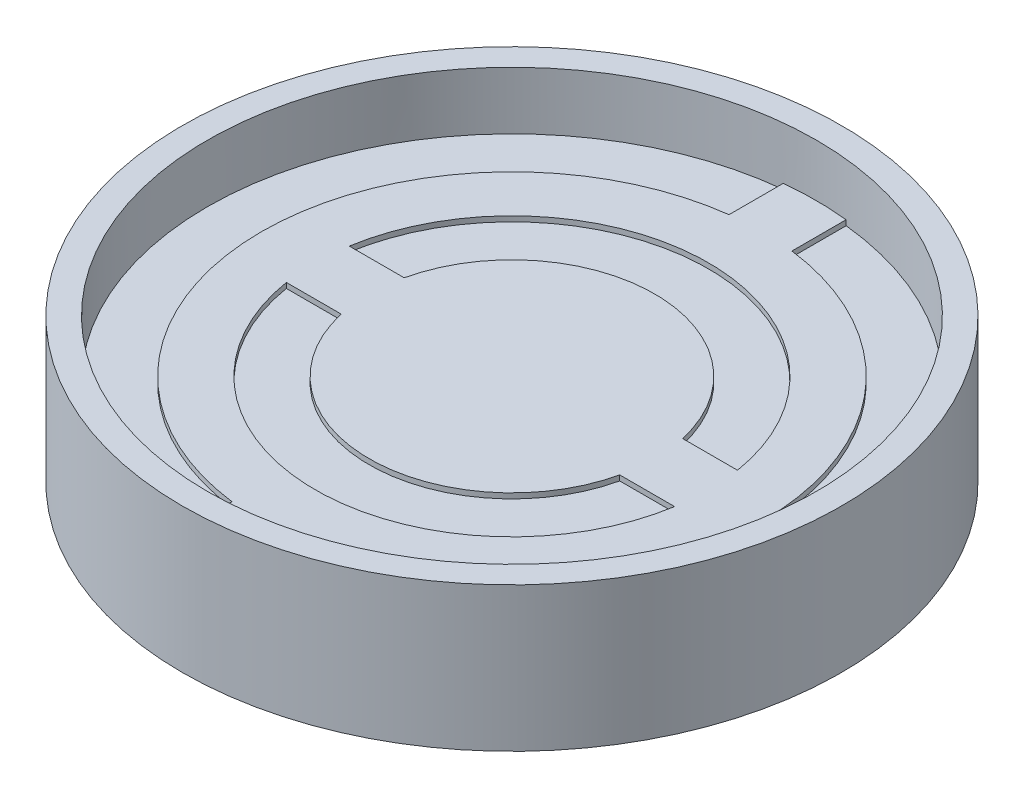
ISO-10303-21;
HEADER;
FILE_DESCRIPTION(('STEP AP214'),'2;1');
FILE_NAME('part.step','',(''),(''),'','','');
FILE_SCHEMA(('AUTOMOTIVE_DESIGN { 1 0 10303 214 1 1 1 1 }'));
ENDSEC;
DATA;
#1=APPLICATION_CONTEXT('core data for automotive mechanical design processes');
#2=APPLICATION_PROTOCOL_DEFINITION('international standard','automotive_design',2000,#1);
#3=PRODUCT_CONTEXT('',#1,'mechanical');
#4=PRODUCT('Part','Part','',(#3));
#5=PRODUCT_RELATED_PRODUCT_CATEGORY('part','',(#4));
#6=PRODUCT_DEFINITION_FORMATION('','',#4);
#7=PRODUCT_DEFINITION_CONTEXT('part definition',#1,'design');
#8=PRODUCT_DEFINITION('design','',#6,#7);
#9=PRODUCT_DEFINITION_SHAPE('','',#8);
#10=(LENGTH_UNIT() NAMED_UNIT(*) SI_UNIT(.MILLI.,.METRE.));
#11=(NAMED_UNIT(*) PLANE_ANGLE_UNIT() SI_UNIT($,.RADIAN.));
#12=(NAMED_UNIT(*) SI_UNIT($,.STERADIAN.) SOLID_ANGLE_UNIT());
#13=UNCERTAINTY_MEASURE_WITH_UNIT(LENGTH_MEASURE(1.E-05),#10,'distance_accuracy_value','');
#14=(GEOMETRIC_REPRESENTATION_CONTEXT(3) GLOBAL_UNCERTAINTY_ASSIGNED_CONTEXT((#13)) GLOBAL_UNIT_ASSIGNED_CONTEXT((#10,
#11,#12)) REPRESENTATION_CONTEXT('',''));
#15=CARTESIAN_POINT('',(0.,0.,0.));
#16=DIRECTION('',(0.,0.,1.));
#17=DIRECTION('',(1.,0.,0.));
#18=AXIS2_PLACEMENT_3D('',#15,#16,#17);
#19=CARTESIAN_POINT('',(0.,-0.6985,0.));
#20=DIRECTION('',(0.,-1.,0.));
#21=DIRECTION('',(0.,0.,1.));
#22=AXIS2_PLACEMENT_3D('',#19,#20,#21);
#23=PLANE('',#22);
#24=CARTESIAN_POINT('',(0.,-0.6985,0.));
#25=DIRECTION('',(0.,1.,0.));
#26=DIRECTION('',(0.,0.,1.));
#27=AXIS2_PLACEMENT_3D('',#24,#25,#26);
#28=CIRCLE('',#27,12.13485);
#29=CARTESIAN_POINT('',(1.524,-0.6985,12.0387710553237));
#30=VERTEX_POINT('',#29);
#31=CARTESIAN_POINT('',(1.524,-0.6985,-12.0387710553237));
#32=VERTEX_POINT('',#31);
#33=EDGE_CURVE('E360',#30,#32,#28,.T.);
#34=ORIENTED_EDGE('',*,*,#33,.T.);
#35=DIRECTION('',(0.,0.,1.));
#36=VECTOR('',#35,1.);
#37=CARTESIAN_POINT('',(1.524,-0.6985,0.));
#38=LINE('',#37,#36);
#39=CARTESIAN_POINT('',(1.524,-0.6985,-14.6657288291445));
#40=VERTEX_POINT('',#39);
#41=EDGE_CURVE('E356',#40,#32,#38,.T.);
#42=ORIENTED_EDGE('',*,*,#41,.F.);
#43=CARTESIAN_POINT('',(0.,-0.6985,0.));
#44=DIRECTION('',(0.,1.,0.));
#45=DIRECTION('',(0.,0.,1.));
#46=AXIS2_PLACEMENT_3D('',#43,#44,#45);
#47=CIRCLE('',#46,14.7447);
#48=CARTESIAN_POINT('',(1.524,-0.6985,14.6657288291445));
#49=VERTEX_POINT('',#48);
#50=EDGE_CURVE('E422',#49,#40,#47,.T.);
#51=ORIENTED_EDGE('',*,*,#50,.F.);
#52=DIRECTION('',(0.,0.,-1.));
#53=VECTOR('',#52,1.);
#54=CARTESIAN_POINT('',(1.524,-0.6985,0.));
#55=LINE('',#54,#53);
#56=EDGE_CURVE('E363',#49,#30,#55,.T.);
#57=ORIENTED_EDGE('',*,*,#56,.T.);
#58=EDGE_LOOP('',(#34,#42,#51,#57));
#59=FACE_BOUND('',#58,.T.);
#60=ADVANCED_FACE('F47',(#59),#23,.T.);
#61=CARTESIAN_POINT('',(0.,0.6985,0.));
#62=DIRECTION('',(0.,1.,0.));
#63=DIRECTION('',(0.,0.,1.));
#64=AXIS2_PLACEMENT_3D('',#61,#62,#63);
#65=CYLINDRICAL_SURFACE('',#64,14.7447);
#66=CARTESIAN_POINT('',(0.,3.4925,0.));
#67=DIRECTION('',(0.,1.,0.));
#68=DIRECTION('',(0.,0.,1.));
#69=AXIS2_PLACEMENT_3D('',#66,#67,#68);
#70=CIRCLE('',#69,14.7447);
#71=CARTESIAN_POINT('',(0.,3.4925,14.7447));
#72=VERTEX_POINT('',#71);
#73=EDGE_CURVE('E562',#72,#72,#70,.T.);
#74=ORIENTED_EDGE('',*,*,#73,.T.);
#75=EDGE_LOOP('',(#74));
#76=FACE_BOUND('',#75,.T.);
#77=DIRECTION('',(0.,-1.,0.));
#78=VECTOR('',#77,1.);
#79=CARTESIAN_POINT('',(-1.524,0.9525,-14.6657288291445));
#80=LINE('',#79,#78);
#81=CARTESIAN_POINT('',(-1.524,0.9525,-14.6657288291445));
#82=VERTEX_POINT('',#81);
#83=CARTESIAN_POINT('',(-1.524,0.6985,-14.6657288291445));
#84=VERTEX_POINT('',#83);
#85=EDGE_CURVE('E530',#82,#84,#80,.T.);
#86=ORIENTED_EDGE('',*,*,#85,.F.);
#87=CARTESIAN_POINT('',(0.,0.9525,0.));
#88=DIRECTION('',(0.,1.,0.));
#89=DIRECTION('',(0.,0.,1.));
#90=AXIS2_PLACEMENT_3D('',#87,#88,#89);
#91=CIRCLE('',#90,14.7447);
#92=CARTESIAN_POINT('',(1.524,0.9525,-14.6657288291445));
#93=VERTEX_POINT('',#92);
#94=EDGE_CURVE('E482',#93,#82,#91,.T.);
#95=ORIENTED_EDGE('',*,*,#94,.F.);
#96=DIRECTION('',(0.,-1.,0.));
#97=VECTOR('',#96,1.);
#98=CARTESIAN_POINT('',(1.524,0.9525,-14.6657288291445));
#99=LINE('',#98,#97);
#100=CARTESIAN_POINT('',(1.524,0.6985,-14.6657288291445));
#101=VERTEX_POINT('',#100);
#102=EDGE_CURVE('E534',#93,#101,#99,.T.);
#103=ORIENTED_EDGE('',*,*,#102,.T.);
#104=CARTESIAN_POINT('',(0.,0.6985,0.));
#105=DIRECTION('',(0.,1.,0.));
#106=DIRECTION('',(0.,0.,1.));
#107=AXIS2_PLACEMENT_3D('',#104,#105,#106);
#108=CIRCLE('',#107,14.7447);
#109=CARTESIAN_POINT('',(1.524,0.6985,14.6657288291445));
#110=VERTEX_POINT('',#109);
#111=EDGE_CURVE('E591',#110,#101,#108,.T.);
#112=ORIENTED_EDGE('',*,*,#111,.F.);
#113=DIRECTION('',(0.,-1.,0.));
#114=VECTOR('',#113,1.);
#115=CARTESIAN_POINT('',(1.524,0.9525,14.6657288291445));
#116=LINE('',#115,#114);
#117=CARTESIAN_POINT('',(1.524,0.9525,14.6657288291445));
#118=VERTEX_POINT('',#117);
#119=EDGE_CURVE('E547',#118,#110,#116,.T.);
#120=ORIENTED_EDGE('',*,*,#119,.F.);
#121=CARTESIAN_POINT('',(0.,0.9525,0.));
#122=DIRECTION('',(0.,1.,0.));
#123=DIRECTION('',(0.,0.,1.));
#124=AXIS2_PLACEMENT_3D('',#121,#122,#123);
#125=CIRCLE('',#124,14.7447);
#126=CARTESIAN_POINT('',(-1.524,0.9525,14.6657288291445));
#127=VERTEX_POINT('',#126);
#128=EDGE_CURVE('E471',#127,#118,#125,.T.);
#129=ORIENTED_EDGE('',*,*,#128,.F.);
#130=DIRECTION('',(0.,-1.,0.));
#131=VECTOR('',#130,1.);
#132=CARTESIAN_POINT('',(-1.524,0.9525,14.6657288291445));
#133=LINE('',#132,#131);
#134=CARTESIAN_POINT('',(-1.524,0.6985,14.6657288291445));
#135=VERTEX_POINT('',#134);
#136=EDGE_CURVE('E551',#127,#135,#133,.T.);
#137=ORIENTED_EDGE('',*,*,#136,.T.);
#138=EDGE_CURVE('E594',#84,#135,#108,.T.);
#139=ORIENTED_EDGE('',*,*,#138,.F.);
#140=EDGE_LOOP('',(#86,#95,#103,#112,#120,#129,#137,#139));
#141=FACE_BOUND('',#140,.T.);
#142=ADVANCED_FACE('F617',(#76,#141),#65,.F.);
#143=CARTESIAN_POINT('',(0.,0.6985,0.));
#144=DIRECTION('',(0.,1.,0.));
#145=DIRECTION('',(0.,0.,1.));
#146=AXIS2_PLACEMENT_3D('',#143,#144,#145);
#147=PLANE('',#146);
#148=CARTESIAN_POINT('',(0.,0.6985,0.));
#149=DIRECTION('',(0.,1.,0.));
#150=DIRECTION('',(0.,0.,1.));
#151=AXIS2_PLACEMENT_3D('',#148,#149,#150);
#152=CIRCLE('',#151,12.13485);
#153=CARTESIAN_POINT('',(-1.524,0.6985,-12.0387710553237));
#154=VERTEX_POINT('',#153);
#155=CARTESIAN_POINT('',(-1.524,0.6985,12.0387710553237));
#156=VERTEX_POINT('',#155);
#157=EDGE_CURVE('E516',#154,#156,#152,.T.);
#158=ORIENTED_EDGE('',*,*,#157,.F.);
#159=DIRECTION('',(0.,0.,1.));
#160=VECTOR('',#159,1.);
#161=CARTESIAN_POINT('',(-1.524,0.6985,0.));
#162=LINE('',#161,#160);
#163=EDGE_CURVE('E512',#84,#154,#162,.T.);
#164=ORIENTED_EDGE('',*,*,#163,.F.);
#165=ORIENTED_EDGE('',*,*,#138,.T.);
#166=DIRECTION('',(0.,0.,-1.));
#167=VECTOR('',#166,1.);
#168=CARTESIAN_POINT('',(-1.524,0.6985,0.));
#169=LINE('',#168,#167);
#170=EDGE_CURVE('E520',#135,#156,#169,.T.);
#171=ORIENTED_EDGE('',*,*,#170,.T.);
#172=EDGE_LOOP('',(#158,#164,#165,#171));
#173=FACE_BOUND('',#172,.T.);
#174=ADVANCED_FACE('F604',(#173),#147,.T.);
#175=CARTESIAN_POINT('',(1.524,0.6985,12.0387710553237));
#176=VERTEX_POINT('',#175);
#177=CARTESIAN_POINT('',(1.524,0.6985,-12.0387710553237));
#178=VERTEX_POINT('',#177);
#179=EDGE_CURVE('E521',#176,#178,#152,.T.);
#180=ORIENTED_EDGE('',*,*,#179,.F.);
#181=DIRECTION('',(0.,0.,-1.));
#182=VECTOR('',#181,1.);
#183=CARTESIAN_POINT('',(1.524,0.6985,0.));
#184=LINE('',#183,#182);
#185=EDGE_CURVE('E524',#110,#176,#184,.T.);
#186=ORIENTED_EDGE('',*,*,#185,.F.);
#187=ORIENTED_EDGE('',*,*,#111,.T.);
#188=DIRECTION('',(0.,0.,1.));
#189=VECTOR('',#188,1.);
#190=CARTESIAN_POINT('',(1.524,0.6985,0.));
#191=LINE('',#190,#189);
#192=EDGE_CURVE('E435',#101,#178,#191,.T.);
#193=ORIENTED_EDGE('',*,*,#192,.T.);
#194=EDGE_LOOP('',(#180,#186,#187,#193));
#195=FACE_BOUND('',#194,.T.);
#196=ADVANCED_FACE('F827',(#195),#147,.T.);
#197=CARTESIAN_POINT('',(0.,3.4925,0.));
#198=DIRECTION('',(0.,-1.,0.));
#199=DIRECTION('',(0.,0.,-1.));
#200=AXIS2_PLACEMENT_3D('',#197,#198,#199);
#201=CYLINDRICAL_SURFACE('',#200,15.9639);
#202=CARTESIAN_POINT('',(0.,3.4925,0.));
#203=DIRECTION('',(0.,1.,0.));
#204=DIRECTION('',(0.,0.,1.));
#205=AXIS2_PLACEMENT_3D('',#202,#203,#204);
#206=CIRCLE('',#205,15.9639);
#207=CARTESIAN_POINT('',(0.,3.4925,15.9639));
#208=VERTEX_POINT('',#207);
#209=EDGE_CURVE('E11',#208,#208,#206,.T.);
#210=ORIENTED_EDGE('',*,*,#209,.F.);
#211=EDGE_LOOP('',(#210));
#212=FACE_BOUND('',#211,.T.);
#213=CARTESIAN_POINT('',(0.,-3.4925,0.));
#214=DIRECTION('',(0.,1.,0.));
#215=DIRECTION('',(0.,0.,1.));
#216=AXIS2_PLACEMENT_3D('',#213,#214,#215);
#217=CIRCLE('',#216,15.9639);
#218=CARTESIAN_POINT('',(0.,-3.4925,15.9639));
#219=VERTEX_POINT('',#218);
#220=EDGE_CURVE('E51',#219,#219,#217,.T.);
#221=ORIENTED_EDGE('',*,*,#220,.T.);
#222=EDGE_LOOP('',(#221));
#223=FACE_BOUND('',#222,.T.);
#224=ADVANCED_FACE('F49',(#212,#223),#201,.T.);
#225=CARTESIAN_POINT('',(0.,3.4925,0.));
#226=DIRECTION('',(0.,1.,0.));
#227=DIRECTION('',(0.,0.,1.));
#228=AXIS2_PLACEMENT_3D('',#225,#226,#227);
#229=PLANE('',#228);
#230=ORIENTED_EDGE('',*,*,#73,.F.);
#231=EDGE_LOOP('',(#230));
#232=FACE_BOUND('',#231,.T.);
#233=ORIENTED_EDGE('',*,*,#209,.T.);
#234=EDGE_LOOP('',(#233));
#235=FACE_BOUND('',#234,.T.);
#236=ADVANCED_FACE('F806',(#232,#235),#229,.T.);
#237=CARTESIAN_POINT('',(0.,-3.4925,0.));
#238=DIRECTION('',(0.,1.,0.));
#239=DIRECTION('',(0.,0.,1.));
#240=AXIS2_PLACEMENT_3D('',#237,#238,#239);
#241=PLANE('',#240);
#242=CARTESIAN_POINT('',(0.,-3.4925,0.));
#243=DIRECTION('',(0.,1.,0.));
#244=DIRECTION('',(0.,0.,1.));
#245=AXIS2_PLACEMENT_3D('',#242,#243,#244);
#246=CIRCLE('',#245,14.7447);
#247=CARTESIAN_POINT('',(0.,-3.4925,14.7447));
#248=VERTEX_POINT('',#247);
#249=EDGE_CURVE('E399',#248,#248,#246,.T.);
#250=ORIENTED_EDGE('',*,*,#249,.T.);
#251=EDGE_LOOP('',(#250));
#252=FACE_BOUND('',#251,.T.);
#253=ORIENTED_EDGE('',*,*,#220,.F.);
#254=EDGE_LOOP('',(#253));
#255=FACE_BOUND('',#254,.T.);
#256=ADVANCED_FACE('F802',(#252,#255),#241,.F.);
#257=CARTESIAN_POINT('',(-1.524,0.9525,0.));
#258=DIRECTION('',(1.,0.,0.));
#259=DIRECTION('',(0.,0.,-1.));
#260=AXIS2_PLACEMENT_3D('',#257,#258,#259);
#261=PLANE('',#260);
#262=ORIENTED_EDGE('',*,*,#163,.T.);
#263=DIRECTION('',(0.,-1.,0.));
#264=VECTOR('',#263,1.);
#265=CARTESIAN_POINT('',(-1.524,0.9525,-12.0387710553237));
#266=LINE('',#265,#264);
#267=CARTESIAN_POINT('',(-1.524,0.9525,-12.0387710553237));
#268=VERTEX_POINT('',#267);
#269=EDGE_CURVE('E558',#268,#154,#266,.T.);
#270=ORIENTED_EDGE('',*,*,#269,.F.);
#271=DIRECTION('',(0.,0.,1.));
#272=VECTOR('',#271,1.);
#273=CARTESIAN_POINT('',(-1.524,0.9525,0.));
#274=LINE('',#273,#272);
#275=EDGE_CURVE('E459',#82,#268,#274,.T.);
#276=ORIENTED_EDGE('',*,*,#275,.F.);
#277=ORIENTED_EDGE('',*,*,#85,.T.);
#278=EDGE_LOOP('',(#262,#270,#276,#277));
#279=FACE_BOUND('',#278,.T.);
#280=ADVANCED_FACE('F616',(#279),#261,.F.);
#281=CARTESIAN_POINT('',(0.,0.9525,0.));
#282=DIRECTION('',(0.,-1.,0.));
#283=DIRECTION('',(0.,0.,-1.));
#284=AXIS2_PLACEMENT_3D('',#281,#282,#283);
#285=CYLINDRICAL_SURFACE('',#284,12.13485);
#286=ORIENTED_EDGE('',*,*,#157,.T.);
#287=DIRECTION('',(0.,-1.,0.));
#288=VECTOR('',#287,1.);
#289=CARTESIAN_POINT('',(-1.524,0.9525,12.0387710553237));
#290=LINE('',#289,#288);
#291=CARTESIAN_POINT('',(-1.524,0.9525,12.0387710553237));
#292=VERTEX_POINT('',#291);
#293=EDGE_CURVE('E554',#292,#156,#290,.T.);
#294=ORIENTED_EDGE('',*,*,#293,.F.);
#295=CARTESIAN_POINT('',(0.,0.9525,0.));
#296=DIRECTION('',(0.,1.,0.));
#297=DIRECTION('',(0.,0.,1.));
#298=AXIS2_PLACEMENT_3D('',#295,#296,#297);
#299=CIRCLE('',#298,12.13485);
#300=EDGE_CURVE('E463',#268,#292,#299,.T.);
#301=ORIENTED_EDGE('',*,*,#300,.F.);
#302=ORIENTED_EDGE('',*,*,#269,.T.);
#303=EDGE_LOOP('',(#286,#294,#301,#302));
#304=FACE_BOUND('',#303,.T.);
#305=ADVANCED_FACE('F612',(#304),#285,.T.);
#306=CARTESIAN_POINT('',(-1.524,0.9525,0.));
#307=DIRECTION('',(-1.,0.,0.));
#308=DIRECTION('',(0.,0.,1.));
#309=AXIS2_PLACEMENT_3D('',#306,#307,#308);
#310=PLANE('',#309);
#311=ORIENTED_EDGE('',*,*,#170,.F.);
#312=ORIENTED_EDGE('',*,*,#136,.F.);
#313=DIRECTION('',(0.,0.,-1.));
#314=VECTOR('',#313,1.);
#315=CARTESIAN_POINT('',(-1.524,0.9525,0.));
#316=LINE('',#315,#314);
#317=EDGE_CURVE('E466',#127,#292,#316,.T.);
#318=ORIENTED_EDGE('',*,*,#317,.T.);
#319=ORIENTED_EDGE('',*,*,#293,.T.);
#320=EDGE_LOOP('',(#311,#312,#318,#319));
#321=FACE_BOUND('',#320,.T.);
#322=ADVANCED_FACE('F608',(#321),#310,.T.);
#323=CARTESIAN_POINT('',(1.524,0.9525,0.));
#324=DIRECTION('',(-1.,0.,0.));
#325=DIRECTION('',(0.,0.,1.));
#326=AXIS2_PLACEMENT_3D('',#323,#324,#325);
#327=PLANE('',#326);
#328=ORIENTED_EDGE('',*,*,#185,.T.);
#329=DIRECTION('',(0.,-1.,0.));
#330=VECTOR('',#329,1.);
#331=CARTESIAN_POINT('',(1.524,0.9525,12.0387710553237));
#332=LINE('',#331,#330);
#333=CARTESIAN_POINT('',(1.524,0.9525,12.0387710553237));
#334=VERTEX_POINT('',#333);
#335=EDGE_CURVE('E543',#334,#176,#332,.T.);
#336=ORIENTED_EDGE('',*,*,#335,.F.);
#337=DIRECTION('',(0.,0.,-1.));
#338=VECTOR('',#337,1.);
#339=CARTESIAN_POINT('',(1.524,0.9525,0.));
#340=LINE('',#339,#338);
#341=EDGE_CURVE('E475',#118,#334,#340,.T.);
#342=ORIENTED_EDGE('',*,*,#341,.F.);
#343=ORIENTED_EDGE('',*,*,#119,.T.);
#344=EDGE_LOOP('',(#328,#336,#342,#343));
#345=FACE_BOUND('',#344,.T.);
#346=ADVANCED_FACE('F632',(#345),#327,.F.);
#347=ORIENTED_EDGE('',*,*,#179,.T.);
#348=DIRECTION('',(0.,-1.,0.));
#349=VECTOR('',#348,1.);
#350=CARTESIAN_POINT('',(1.524,0.9525,-12.0387710553237));
#351=LINE('',#350,#349);
#352=CARTESIAN_POINT('',(1.524,0.9525,-12.0387710553237));
#353=VERTEX_POINT('',#352);
#354=EDGE_CURVE('E539',#353,#178,#351,.T.);
#355=ORIENTED_EDGE('',*,*,#354,.F.);
#356=EDGE_CURVE('E467',#334,#353,#299,.T.);
#357=ORIENTED_EDGE('',*,*,#356,.F.);
#358=ORIENTED_EDGE('',*,*,#335,.T.);
#359=EDGE_LOOP('',(#347,#355,#357,#358));
#360=FACE_BOUND('',#359,.T.);
#361=ADVANCED_FACE('F635',(#360),#285,.T.);
#362=CARTESIAN_POINT('',(1.524,0.9525,0.));
#363=DIRECTION('',(1.,0.,0.));
#364=DIRECTION('',(0.,0.,-1.));
#365=AXIS2_PLACEMENT_3D('',#362,#363,#364);
#366=PLANE('',#365);
#367=ORIENTED_EDGE('',*,*,#192,.F.);
#368=ORIENTED_EDGE('',*,*,#102,.F.);
#369=DIRECTION('',(0.,0.,1.));
#370=VECTOR('',#369,1.);
#371=CARTESIAN_POINT('',(1.524,0.9525,0.));
#372=LINE('',#371,#370);
#373=EDGE_CURVE('E478',#93,#353,#372,.T.);
#374=ORIENTED_EDGE('',*,*,#373,.T.);
#375=ORIENTED_EDGE('',*,*,#354,.T.);
#376=EDGE_LOOP('',(#367,#368,#374,#375));
#377=FACE_BOUND('',#376,.T.);
#378=ADVANCED_FACE('F626',(#377),#366,.T.);
#379=CARTESIAN_POINT('',(0.,0.9525,0.));
#380=DIRECTION('',(0.,-1.,0.));
#381=DIRECTION('',(0.,0.,-1.));
#382=AXIS2_PLACEMENT_3D('',#379,#380,#381);
#383=CYLINDRICAL_SURFACE('',#382,9.525);
#384=CARTESIAN_POINT('',(0.,0.6985,0.));
#385=DIRECTION('',(0.,1.,0.));
#386=DIRECTION('',(0.,0.,1.));
#387=AXIS2_PLACEMENT_3D('',#384,#385,#386);
#388=CIRCLE('',#387,9.525);
#389=CARTESIAN_POINT('',(9.40228956159084,0.6985,-1.524));
#390=VERTEX_POINT('',#389);
#391=CARTESIAN_POINT('',(-9.40228956159084,0.6985,-1.524));
#392=VERTEX_POINT('',#391);
#393=EDGE_CURVE('E502',#390,#392,#388,.T.);
#394=ORIENTED_EDGE('',*,*,#393,.F.);
#395=DIRECTION('',(0.,-1.,0.));
#396=VECTOR('',#395,1.);
#397=CARTESIAN_POINT('',(9.40228956159084,0.9525,-1.524));
#398=LINE('',#397,#396);
#399=CARTESIAN_POINT('',(9.40228956159084,0.9525,-1.524));
#400=VERTEX_POINT('',#399);
#401=EDGE_CURVE('E535',#400,#390,#398,.T.);
#402=ORIENTED_EDGE('',*,*,#401,.F.);
#403=CARTESIAN_POINT('',(0.,0.9525,0.));
#404=DIRECTION('',(0.,1.,0.));
#405=DIRECTION('',(0.,0.,1.));
#406=AXIS2_PLACEMENT_3D('',#403,#404,#405);
#407=CIRCLE('',#406,9.525);
#408=CARTESIAN_POINT('',(-9.40228956159084,0.9525,-1.524));
#409=VERTEX_POINT('',#408);
#410=EDGE_CURVE('E447',#400,#409,#407,.T.);
#411=ORIENTED_EDGE('',*,*,#410,.T.);
#412=DIRECTION('',(0.,-1.,0.));
#413=VECTOR('',#412,1.);
#414=CARTESIAN_POINT('',(-9.40228956159084,0.9525,-1.524));
#415=LINE('',#414,#413);
#416=EDGE_CURVE('E563',#409,#392,#415,.T.);
#417=ORIENTED_EDGE('',*,*,#416,.T.);
#418=EDGE_LOOP('',(#394,#402,#411,#417));
#419=FACE_BOUND('',#418,.T.);
#420=ADVANCED_FACE('F920',(#419),#383,.F.);
#421=CARTESIAN_POINT('',(0.,0.9525,-1.524));
#422=DIRECTION('',(0.,0.,1.));
#423=DIRECTION('',(1.,0.,0.));
#424=AXIS2_PLACEMENT_3D('',#421,#422,#423);
#425=PLANE('',#424);
#426=DIRECTION('',(-1.,0.,0.));
#427=VECTOR('',#426,1.);
#428=CARTESIAN_POINT('',(0.,0.6985,-1.524));
#429=LINE('',#428,#427);
#430=CARTESIAN_POINT('',(6.7451259085728,0.6985,-1.524));
#431=VERTEX_POINT('',#430);
#432=EDGE_CURVE('E505',#390,#431,#429,.T.);
#433=ORIENTED_EDGE('',*,*,#432,.T.);
#434=DIRECTION('',(0.,-1.,0.));
#435=VECTOR('',#434,1.);
#436=CARTESIAN_POINT('',(6.7451259085728,0.9525,-1.524));
#437=LINE('',#436,#435);
#438=CARTESIAN_POINT('',(6.7451259085728,0.9525,-1.524));
#439=VERTEX_POINT('',#438);
#440=EDGE_CURVE('E572',#439,#431,#437,.T.);
#441=ORIENTED_EDGE('',*,*,#440,.F.);
#442=DIRECTION('',(-1.,0.,0.));
#443=VECTOR('',#442,1.);
#444=CARTESIAN_POINT('',(0.,0.9525,-1.524));
#445=LINE('',#444,#443);
#446=EDGE_CURVE('E451',#400,#439,#445,.T.);
#447=ORIENTED_EDGE('',*,*,#446,.F.);
#448=ORIENTED_EDGE('',*,*,#401,.T.);
#449=EDGE_LOOP('',(#433,#441,#447,#448));
#450=FACE_BOUND('',#449,.T.);
#451=ADVANCED_FACE('F910',(#450),#425,.F.);
#452=CARTESIAN_POINT('',(0.,0.9525,0.));
#453=DIRECTION('',(0.,-1.,0.));
#454=DIRECTION('',(0.,0.,-1.));
#455=AXIS2_PLACEMENT_3D('',#452,#453,#454);
#456=CYLINDRICAL_SURFACE('',#455,6.91515);
#457=CARTESIAN_POINT('',(0.,0.6985,0.));
#458=DIRECTION('',(0.,1.,0.));
#459=DIRECTION('',(0.,0.,1.));
#460=AXIS2_PLACEMENT_3D('',#457,#458,#459);
#461=CIRCLE('',#460,6.91515);
#462=CARTESIAN_POINT('',(-6.7451259085728,0.6985,-1.524));
#463=VERTEX_POINT('',#462);
#464=EDGE_CURVE('E491',#431,#463,#461,.T.);
#465=ORIENTED_EDGE('',*,*,#464,.T.);
#466=DIRECTION('',(0.,-1.,0.));
#467=VECTOR('',#466,1.);
#468=CARTESIAN_POINT('',(-6.7451259085728,0.9525,-1.524));
#469=LINE('',#468,#467);
#470=CARTESIAN_POINT('',(-6.7451259085728,0.9525,-1.524));
#471=VERTEX_POINT('',#470);
#472=EDGE_CURVE('E567',#471,#463,#469,.T.);
#473=ORIENTED_EDGE('',*,*,#472,.F.);
#474=CARTESIAN_POINT('',(0.,0.9525,0.));
#475=DIRECTION('',(0.,1.,0.));
#476=DIRECTION('',(0.,0.,1.));
#477=AXIS2_PLACEMENT_3D('',#474,#475,#476);
#478=CIRCLE('',#477,6.91515);
#479=EDGE_CURVE('E436',#439,#471,#478,.T.);
#480=ORIENTED_EDGE('',*,*,#479,.F.);
#481=ORIENTED_EDGE('',*,*,#440,.T.);
#482=EDGE_LOOP('',(#465,#473,#480,#481));
#483=FACE_BOUND('',#482,.T.);
#484=ADVANCED_FACE('F899',(#483),#456,.T.);
#485=CARTESIAN_POINT('',(-6.7451259085728,0.6985,1.524));
#486=VERTEX_POINT('',#485);
#487=CARTESIAN_POINT('',(6.7451259085728,0.6985,1.524));
#488=VERTEX_POINT('',#487);
#489=EDGE_CURVE('E426',#486,#488,#461,.T.);
#490=ORIENTED_EDGE('',*,*,#489,.T.);
#491=DIRECTION('',(0.,-1.,0.));
#492=VECTOR('',#491,1.);
#493=CARTESIAN_POINT('',(6.7451259085728,0.9525,1.524));
#494=LINE('',#493,#492);
#495=CARTESIAN_POINT('',(6.7451259085728,0.9525,1.524));
#496=VERTEX_POINT('',#495);
#497=EDGE_CURVE('E568',#496,#488,#494,.T.);
#498=ORIENTED_EDGE('',*,*,#497,.F.);
#499=CARTESIAN_POINT('',(-6.7451259085728,0.9525,1.524));
#500=VERTEX_POINT('',#499);
#501=EDGE_CURVE('E431',#500,#496,#478,.T.);
#502=ORIENTED_EDGE('',*,*,#501,.F.);
#503=DIRECTION('',(0.,-1.,0.));
#504=VECTOR('',#503,1.);
#505=CARTESIAN_POINT('',(-6.7451259085728,0.9525,1.524));
#506=LINE('',#505,#504);
#507=EDGE_CURVE('E486',#500,#486,#506,.T.);
#508=ORIENTED_EDGE('',*,*,#507,.T.);
#509=EDGE_LOOP('',(#490,#498,#502,#508));
#510=FACE_BOUND('',#509,.T.);
#511=ADVANCED_FACE('F888',(#510),#456,.T.);
#512=CARTESIAN_POINT('',(0.,0.9525,1.524));
#513=DIRECTION('',(0.,0.,1.));
#514=DIRECTION('',(1.,0.,0.));
#515=AXIS2_PLACEMENT_3D('',#512,#513,#514);
#516=PLANE('',#515);
#517=DIRECTION('',(-1.,0.,0.));
#518=VECTOR('',#517,1.);
#519=CARTESIAN_POINT('',(0.,0.6985,1.524));
#520=LINE('',#519,#518);
#521=CARTESIAN_POINT('',(9.40228956159084,0.6985,1.524));
#522=VERTEX_POINT('',#521);
#523=EDGE_CURVE('E490',#522,#488,#520,.T.);
#524=ORIENTED_EDGE('',*,*,#523,.F.);
#525=DIRECTION('',(0.,-1.,0.));
#526=VECTOR('',#525,1.);
#527=CARTESIAN_POINT('',(9.40228956159084,0.9525,1.524));
#528=LINE('',#527,#526);
#529=CARTESIAN_POINT('',(9.40228956159084,0.9525,1.524));
#530=VERTEX_POINT('',#529);
#531=EDGE_CURVE('E586',#530,#522,#528,.T.);
#532=ORIENTED_EDGE('',*,*,#531,.F.);
#533=DIRECTION('',(-1.,0.,0.));
#534=VECTOR('',#533,1.);
#535=CARTESIAN_POINT('',(0.,0.9525,1.524));
#536=LINE('',#535,#534);
#537=EDGE_CURVE('E434',#530,#496,#536,.T.);
#538=ORIENTED_EDGE('',*,*,#537,.T.);
#539=ORIENTED_EDGE('',*,*,#497,.T.);
#540=EDGE_LOOP('',(#524,#532,#538,#539));
#541=FACE_BOUND('',#540,.T.);
#542=ADVANCED_FACE('F877',(#541),#516,.T.);
#543=CARTESIAN_POINT('',(0.,0.9525,0.));
#544=DIRECTION('',(0.,-1.,0.));
#545=DIRECTION('',(0.,0.,-1.));
#546=AXIS2_PLACEMENT_3D('',#543,#544,#545);
#547=CYLINDRICAL_SURFACE('',#546,9.525);
#548=CARTESIAN_POINT('',(0.,0.6985,0.));
#549=DIRECTION('',(0.,1.,0.));
#550=DIRECTION('',(0.,0.,1.));
#551=AXIS2_PLACEMENT_3D('',#548,#549,#550);
#552=CIRCLE('',#551,9.525);
#553=CARTESIAN_POINT('',(-9.40228956159084,0.6985,1.524));
#554=VERTEX_POINT('',#553);
#555=EDGE_CURVE('E495',#554,#522,#552,.T.);
#556=ORIENTED_EDGE('',*,*,#555,.F.);
#557=DIRECTION('',(0.,-1.,0.));
#558=VECTOR('',#557,1.);
#559=CARTESIAN_POINT('',(-9.40228956159084,0.9525,1.524));
#560=LINE('',#559,#558);
#561=CARTESIAN_POINT('',(-9.40228956159084,0.9525,1.524));
#562=VERTEX_POINT('',#561);
#563=EDGE_CURVE('E582',#562,#554,#560,.T.);
#564=ORIENTED_EDGE('',*,*,#563,.F.);
#565=CARTESIAN_POINT('',(0.,0.9525,0.));
#566=DIRECTION('',(0.,1.,0.));
#567=DIRECTION('',(0.,0.,1.));
#568=AXIS2_PLACEMENT_3D('',#565,#566,#567);
#569=CIRCLE('',#568,9.525);
#570=EDGE_CURVE('E440',#562,#530,#569,.T.);
#571=ORIENTED_EDGE('',*,*,#570,.T.);
#572=ORIENTED_EDGE('',*,*,#531,.T.);
#573=EDGE_LOOP('',(#556,#564,#571,#572));
#574=FACE_BOUND('',#573,.T.);
#575=ADVANCED_FACE('F866',(#574),#547,.F.);
#576=CARTESIAN_POINT('',(0.,0.9525,-1.524));
#577=DIRECTION('',(0.,0.,-1.));
#578=DIRECTION('',(-1.,0.,0.));
#579=AXIS2_PLACEMENT_3D('',#576,#577,#578);
#580=PLANE('',#579);
#581=DIRECTION('',(1.,0.,0.));
#582=VECTOR('',#581,1.);
#583=CARTESIAN_POINT('',(0.,0.6985,-1.524));
#584=LINE('',#583,#582);
#585=EDGE_CURVE('E509',#392,#463,#584,.T.);
#586=ORIENTED_EDGE('',*,*,#585,.F.);
#587=ORIENTED_EDGE('',*,*,#416,.F.);
#588=DIRECTION('',(1.,0.,0.));
#589=VECTOR('',#588,1.);
#590=CARTESIAN_POINT('',(0.,0.9525,-1.524));
#591=LINE('',#590,#589);
#592=EDGE_CURVE('E455',#409,#471,#591,.T.);
#593=ORIENTED_EDGE('',*,*,#592,.T.);
#594=ORIENTED_EDGE('',*,*,#472,.T.);
#595=EDGE_LOOP('',(#586,#587,#593,#594));
#596=FACE_BOUND('',#595,.T.);
#597=ADVANCED_FACE('F854',(#596),#580,.T.);
#598=CARTESIAN_POINT('',(0.,0.9525,1.524));
#599=DIRECTION('',(0.,0.,-1.));
#600=DIRECTION('',(-1.,0.,0.));
#601=AXIS2_PLACEMENT_3D('',#598,#599,#600);
#602=PLANE('',#601);
#603=DIRECTION('',(1.,0.,0.));
#604=VECTOR('',#603,1.);
#605=CARTESIAN_POINT('',(0.,0.6985,1.524));
#606=LINE('',#605,#604);
#607=EDGE_CURVE('E499',#554,#486,#606,.T.);
#608=ORIENTED_EDGE('',*,*,#607,.T.);
#609=ORIENTED_EDGE('',*,*,#507,.F.);
#610=DIRECTION('',(1.,0.,0.));
#611=VECTOR('',#610,1.);
#612=CARTESIAN_POINT('',(0.,0.9525,1.524));
#613=LINE('',#612,#611);
#614=EDGE_CURVE('E444',#562,#500,#613,.T.);
#615=ORIENTED_EDGE('',*,*,#614,.F.);
#616=ORIENTED_EDGE('',*,*,#563,.T.);
#617=EDGE_LOOP('',(#608,#609,#615,#616));
#618=FACE_BOUND('',#617,.T.);
#619=ADVANCED_FACE('F843',(#618),#602,.F.);
#620=CARTESIAN_POINT('',(0.,0.9525,0.));
#621=DIRECTION('',(0.,1.,0.));
#622=DIRECTION('',(0.,0.,1.));
#623=AXIS2_PLACEMENT_3D('',#620,#621,#622);
#624=PLANE('',#623);
#625=ORIENTED_EDGE('',*,*,#501,.T.);
#626=ORIENTED_EDGE('',*,*,#537,.F.);
#627=ORIENTED_EDGE('',*,*,#570,.F.);
#628=ORIENTED_EDGE('',*,*,#614,.T.);
#629=EDGE_LOOP('',(#625,#626,#627,#628));
#630=FACE_BOUND('',#629,.T.);
#631=ORIENTED_EDGE('',*,*,#410,.F.);
#632=ORIENTED_EDGE('',*,*,#446,.T.);
#633=ORIENTED_EDGE('',*,*,#479,.T.);
#634=ORIENTED_EDGE('',*,*,#592,.F.);
#635=EDGE_LOOP('',(#631,#632,#633,#634));
#636=FACE_BOUND('',#635,.T.);
#637=ORIENTED_EDGE('',*,*,#275,.T.);
#638=ORIENTED_EDGE('',*,*,#300,.T.);
#639=ORIENTED_EDGE('',*,*,#317,.F.);
#640=ORIENTED_EDGE('',*,*,#128,.T.);
#641=ORIENTED_EDGE('',*,*,#341,.T.);
#642=ORIENTED_EDGE('',*,*,#356,.T.);
#643=ORIENTED_EDGE('',*,*,#373,.F.);
#644=ORIENTED_EDGE('',*,*,#94,.T.);
#645=EDGE_LOOP('',(#637,#638,#639,#640,#641,#642,#643,#644));
#646=FACE_BOUND('',#645,.T.);
#647=ADVANCED_FACE('F621',(#630,#636,#646),#624,.T.);
#648=ORIENTED_EDGE('',*,*,#393,.T.);
#649=ORIENTED_EDGE('',*,*,#585,.T.);
#650=ORIENTED_EDGE('',*,*,#464,.F.);
#651=ORIENTED_EDGE('',*,*,#432,.F.);
#652=EDGE_LOOP('',(#648,#649,#650,#651));
#653=FACE_BOUND('',#652,.T.);
#654=ADVANCED_FACE('F824',(#653),#147,.T.);
#655=ORIENTED_EDGE('',*,*,#523,.T.);
#656=ORIENTED_EDGE('',*,*,#489,.F.);
#657=ORIENTED_EDGE('',*,*,#607,.F.);
#658=ORIENTED_EDGE('',*,*,#555,.T.);
#659=EDGE_LOOP('',(#655,#656,#657,#658));
#660=FACE_BOUND('',#659,.T.);
#661=ADVANCED_FACE('F795',(#660),#147,.T.);
#662=CARTESIAN_POINT('',(0.,-0.6985,0.));
#663=DIRECTION('',(0.,-1.,0.));
#664=DIRECTION('',(0.,0.,-1.));
#665=AXIS2_PLACEMENT_3D('',#662,#663,#664);
#666=CYLINDRICAL_SURFACE('',#665,14.7447);
#667=DIRECTION('',(0.,1.,0.));
#668=VECTOR('',#667,1.);
#669=CARTESIAN_POINT('',(1.524,-0.9525,14.6657288291445));
#670=LINE('',#669,#668);
#671=CARTESIAN_POINT('',(1.524,-0.9525,14.6657288291445));
#672=VERTEX_POINT('',#671);
#673=EDGE_CURVE('E381',#672,#49,#670,.T.);
#674=ORIENTED_EDGE('',*,*,#673,.T.);
#675=ORIENTED_EDGE('',*,*,#50,.T.);
#676=DIRECTION('',(0.,1.,0.));
#677=VECTOR('',#676,1.);
#678=CARTESIAN_POINT('',(1.524,-0.9525,-14.6657288291445));
#679=LINE('',#678,#677);
#680=CARTESIAN_POINT('',(1.524,-0.9525,-14.6657288291445));
#681=VERTEX_POINT('',#680);
#682=EDGE_CURVE('E392',#681,#40,#679,.T.);
#683=ORIENTED_EDGE('',*,*,#682,.F.);
#684=CARTESIAN_POINT('',(0.,-0.9525,0.));
#685=DIRECTION('',(0.,1.,0.));
#686=DIRECTION('',(0.,0.,1.));
#687=AXIS2_PLACEMENT_3D('',#684,#685,#686);
#688=CIRCLE('',#687,14.7447);
#689=CARTESIAN_POINT('',(-1.524,-0.9525,-14.6657288291445));
#690=VERTEX_POINT('',#689);
#691=EDGE_CURVE('E308',#681,#690,#688,.T.);
#692=ORIENTED_EDGE('',*,*,#691,.T.);
#693=DIRECTION('',(0.,1.,0.));
#694=VECTOR('',#693,1.);
#695=CARTESIAN_POINT('',(-1.524,-0.9525,-14.6657288291445));
#696=LINE('',#695,#694);
#697=CARTESIAN_POINT('',(-1.524,-0.6985,-14.6657288291445));
#698=VERTEX_POINT('',#697);
#699=EDGE_CURVE('E396',#690,#698,#696,.T.);
#700=ORIENTED_EDGE('',*,*,#699,.T.);
#701=CARTESIAN_POINT('',(-1.524,-0.6985,14.6657288291445));
#702=VERTEX_POINT('',#701);
#703=EDGE_CURVE('E427',#698,#702,#47,.T.);
#704=ORIENTED_EDGE('',*,*,#703,.T.);
#705=DIRECTION('',(0.,1.,0.));
#706=VECTOR('',#705,1.);
#707=CARTESIAN_POINT('',(-1.524,-0.9525,14.6657288291445));
#708=LINE('',#707,#706);
#709=CARTESIAN_POINT('',(-1.524,-0.9525,14.6657288291445));
#710=VERTEX_POINT('',#709);
#711=EDGE_CURVE('E63',#710,#702,#708,.T.);
#712=ORIENTED_EDGE('',*,*,#711,.F.);
#713=CARTESIAN_POINT('',(0.,-0.9525,0.));
#714=DIRECTION('',(0.,1.,0.));
#715=DIRECTION('',(0.,0.,1.));
#716=AXIS2_PLACEMENT_3D('',#713,#714,#715);
#717=CIRCLE('',#716,14.7447);
#718=EDGE_CURVE('E68',#710,#672,#717,.T.);
#719=ORIENTED_EDGE('',*,*,#718,.T.);
#720=EDGE_LOOP('',(#674,#675,#683,#692,#700,#704,#712,#719));
#721=FACE_BOUND('',#720,.T.);
#722=ORIENTED_EDGE('',*,*,#249,.F.);
#723=EDGE_LOOP('',(#722));
#724=FACE_BOUND('',#723,.T.);
#725=ADVANCED_FACE('F685',(#721,#724),#666,.F.);
#726=DIRECTION('',(0.,0.,1.));
#727=VECTOR('',#726,1.);
#728=CARTESIAN_POINT('',(-1.524,-0.6985,0.));
#729=LINE('',#728,#727);
#730=CARTESIAN_POINT('',(-1.524,-0.6985,-12.0387710553237));
#731=VERTEX_POINT('',#730);
#732=EDGE_CURVE('E353',#698,#731,#729,.T.);
#733=ORIENTED_EDGE('',*,*,#732,.T.);
#734=CARTESIAN_POINT('',(-1.524,-0.6985,12.0387710553237));
#735=VERTEX_POINT('',#734);
#736=EDGE_CURVE('E280',#731,#735,#28,.T.);
#737=ORIENTED_EDGE('',*,*,#736,.T.);
#738=DIRECTION('',(0.,0.,-1.));
#739=VECTOR('',#738,1.);
#740=CARTESIAN_POINT('',(-1.524,-0.6985,0.));
#741=LINE('',#740,#739);
#742=EDGE_CURVE('E366',#702,#735,#741,.T.);
#743=ORIENTED_EDGE('',*,*,#742,.F.);
#744=ORIENTED_EDGE('',*,*,#703,.F.);
#745=EDGE_LOOP('',(#733,#737,#743,#744));
#746=FACE_BOUND('',#745,.T.);
#747=ADVANCED_FACE('F668',(#746),#23,.T.);
#748=CARTESIAN_POINT('',(-1.524,-0.9525,0.));
#749=DIRECTION('',(-1.,0.,0.));
#750=DIRECTION('',(0.,0.,1.));
#751=AXIS2_PLACEMENT_3D('',#748,#749,#750);
#752=PLANE('',#751);
#753=ORIENTED_EDGE('',*,*,#732,.F.);
#754=ORIENTED_EDGE('',*,*,#699,.F.);
#755=DIRECTION('',(0.,0.,1.));
#756=VECTOR('',#755,1.);
#757=CARTESIAN_POINT('',(-1.524,-0.9525,0.));
#758=LINE('',#757,#756);
#759=CARTESIAN_POINT('',(-1.524,-0.9525,-12.0387710553237));
#760=VERTEX_POINT('',#759);
#761=EDGE_CURVE('E304',#690,#760,#758,.T.);
#762=ORIENTED_EDGE('',*,*,#761,.T.);
#763=DIRECTION('',(0.,1.,0.));
#764=VECTOR('',#763,1.);
#765=CARTESIAN_POINT('',(-1.524,-0.9525,-12.0387710553237));
#766=LINE('',#765,#764);
#767=EDGE_CURVE('E370',#760,#731,#766,.T.);
#768=ORIENTED_EDGE('',*,*,#767,.T.);
#769=EDGE_LOOP('',(#753,#754,#762,#768));
#770=FACE_BOUND('',#769,.T.);
#771=ADVANCED_FACE('F695',(#770),#752,.T.);
#772=CARTESIAN_POINT('',(1.524,-0.9525,0.));
#773=DIRECTION('',(-1.,0.,0.));
#774=DIRECTION('',(0.,0.,1.));
#775=AXIS2_PLACEMENT_3D('',#772,#773,#774);
#776=PLANE('',#775);
#777=ORIENTED_EDGE('',*,*,#41,.T.);
#778=DIRECTION('',(0.,1.,0.));
#779=VECTOR('',#778,1.);
#780=CARTESIAN_POINT('',(1.524,-0.9525,-12.0387710553237));
#781=LINE('',#780,#779);
#782=CARTESIAN_POINT('',(1.524,-0.9525,-12.0387710553237));
#783=VERTEX_POINT('',#782);
#784=EDGE_CURVE('E388',#783,#32,#781,.T.);
#785=ORIENTED_EDGE('',*,*,#784,.F.);
#786=DIRECTION('',(0.,0.,1.));
#787=VECTOR('',#786,1.);
#788=CARTESIAN_POINT('',(1.524,-0.9525,0.));
#789=LINE('',#788,#787);
#790=EDGE_CURVE('E311',#681,#783,#789,.T.);
#791=ORIENTED_EDGE('',*,*,#790,.F.);
#792=ORIENTED_EDGE('',*,*,#682,.T.);
#793=EDGE_LOOP('',(#777,#785,#791,#792));
#794=FACE_BOUND('',#793,.T.);
#795=ADVANCED_FACE('F690',(#794),#776,.F.);
#796=CARTESIAN_POINT('',(0.,-0.9525,0.));
#797=DIRECTION('',(0.,1.,0.));
#798=DIRECTION('',(0.,0.,1.));
#799=AXIS2_PLACEMENT_3D('',#796,#797,#798);
#800=CYLINDRICAL_SURFACE('',#799,12.13485);
#801=ORIENTED_EDGE('',*,*,#33,.F.);
#802=DIRECTION('',(0.,1.,0.));
#803=VECTOR('',#802,1.);
#804=CARTESIAN_POINT('',(1.524,-0.9525,12.0387710553237));
#805=LINE('',#804,#803);
#806=CARTESIAN_POINT('',(1.524,-0.9525,12.0387710553237));
#807=VERTEX_POINT('',#806);
#808=EDGE_CURVE('E384',#807,#30,#805,.T.);
#809=ORIENTED_EDGE('',*,*,#808,.F.);
#810=CARTESIAN_POINT('',(0.,-0.9525,0.));
#811=DIRECTION('',(0.,1.,0.));
#812=DIRECTION('',(0.,0.,1.));
#813=AXIS2_PLACEMENT_3D('',#810,#811,#812);
#814=CIRCLE('',#813,12.13485);
#815=EDGE_CURVE('E314',#807,#783,#814,.T.);
#816=ORIENTED_EDGE('',*,*,#815,.T.);
#817=ORIENTED_EDGE('',*,*,#784,.T.);
#818=EDGE_LOOP('',(#801,#809,#816,#817));
#819=FACE_BOUND('',#818,.T.);
#820=ADVANCED_FACE('F702',(#819),#800,.T.);
#821=CARTESIAN_POINT('',(1.524,-0.9525,0.));
#822=DIRECTION('',(1.,0.,0.));
#823=DIRECTION('',(0.,0.,-1.));
#824=AXIS2_PLACEMENT_3D('',#821,#822,#823);
#825=PLANE('',#824);
#826=ORIENTED_EDGE('',*,*,#56,.F.);
#827=ORIENTED_EDGE('',*,*,#673,.F.);
#828=DIRECTION('',(0.,0.,-1.));
#829=VECTOR('',#828,1.);
#830=CARTESIAN_POINT('',(1.524,-0.9525,0.));
#831=LINE('',#830,#829);
#832=EDGE_CURVE('E318',#672,#807,#831,.T.);
#833=ORIENTED_EDGE('',*,*,#832,.T.);
#834=ORIENTED_EDGE('',*,*,#808,.T.);
#835=EDGE_LOOP('',(#826,#827,#833,#834));
#836=FACE_BOUND('',#835,.T.);
#837=ADVANCED_FACE('F682',(#836),#825,.T.);
#838=CARTESIAN_POINT('',(-1.524,-0.9525,0.));
#839=DIRECTION('',(1.,0.,0.));
#840=DIRECTION('',(0.,0.,-1.));
#841=AXIS2_PLACEMENT_3D('',#838,#839,#840);
#842=PLANE('',#841);
#843=ORIENTED_EDGE('',*,*,#742,.T.);
#844=DIRECTION('',(0.,1.,0.));
#845=VECTOR('',#844,1.);
#846=CARTESIAN_POINT('',(-1.524,-0.9525,12.0387710553237));
#847=LINE('',#846,#845);
#848=CARTESIAN_POINT('',(-1.524,-0.9525,12.0387710553237));
#849=VERTEX_POINT('',#848);
#850=EDGE_CURVE('E374',#849,#735,#847,.T.);
#851=ORIENTED_EDGE('',*,*,#850,.F.);
#852=DIRECTION('',(0.,0.,-1.));
#853=VECTOR('',#852,1.);
#854=CARTESIAN_POINT('',(-1.524,-0.9525,0.));
#855=LINE('',#854,#853);
#856=EDGE_CURVE('E325',#710,#849,#855,.T.);
#857=ORIENTED_EDGE('',*,*,#856,.F.);
#858=ORIENTED_EDGE('',*,*,#711,.T.);
#859=EDGE_LOOP('',(#843,#851,#857,#858));
#860=FACE_BOUND('',#859,.T.);
#861=ADVANCED_FACE('F676',(#860),#842,.F.);
#862=CARTESIAN_POINT('',(0.,-0.9525,0.));
#863=DIRECTION('',(0.,1.,0.));
#864=DIRECTION('',(0.,0.,1.));
#865=AXIS2_PLACEMENT_3D('',#862,#863,#864);
#866=CYLINDRICAL_SURFACE('',#865,9.525);
#867=CARTESIAN_POINT('',(0.,-0.6985,0.));
#868=DIRECTION('',(0.,1.,0.));
#869=DIRECTION('',(0.,0.,1.));
#870=AXIS2_PLACEMENT_3D('',#867,#868,#869);
#871=CIRCLE('',#870,9.525);
#872=CARTESIAN_POINT('',(9.40228956159084,-0.6985,-1.524));
#873=VERTEX_POINT('',#872);
#874=CARTESIAN_POINT('',(-9.40228956159084,-0.6985,-1.524));
#875=VERTEX_POINT('',#874);
#876=EDGE_CURVE('E342',#873,#875,#871,.T.);
#877=ORIENTED_EDGE('',*,*,#876,.T.);
#878=DIRECTION('',(0.,1.,0.));
#879=VECTOR('',#878,1.);
#880=CARTESIAN_POINT('',(-9.40228956159084,-0.9525,-1.524));
#881=LINE('',#880,#879);
#882=CARTESIAN_POINT('',(-9.40228956159084,-0.9525,-1.524));
#883=VERTEX_POINT('',#882);
#884=EDGE_CURVE('E375',#883,#875,#881,.T.);
#885=ORIENTED_EDGE('',*,*,#884,.F.);
#886=CARTESIAN_POINT('',(0.,-0.9525,0.));
#887=DIRECTION('',(0.,1.,0.));
#888=DIRECTION('',(0.,0.,1.));
#889=AXIS2_PLACEMENT_3D('',#886,#887,#888);
#890=CIRCLE('',#889,9.525);
#891=CARTESIAN_POINT('',(9.40228956159084,-0.9525,-1.524));
#892=VERTEX_POINT('',#891);
#893=EDGE_CURVE('E293',#892,#883,#890,.T.);
#894=ORIENTED_EDGE('',*,*,#893,.F.);
#895=DIRECTION('',(0.,1.,0.));
#896=VECTOR('',#895,1.);
#897=CARTESIAN_POINT('',(9.40228956159084,-0.9525,-1.524));
#898=LINE('',#897,#896);
#899=EDGE_CURVE('E268',#892,#873,#898,.T.);
#900=ORIENTED_EDGE('',*,*,#899,.T.);
#901=EDGE_LOOP('',(#877,#885,#894,#900));
#902=FACE_BOUND('',#901,.T.);
#903=ADVANCED_FACE('F659',(#902),#866,.F.);
#904=CARTESIAN_POINT('',(0.,-0.9525,-1.524));
#905=DIRECTION('',(0.,0.,1.));
#906=DIRECTION('',(1.,0.,0.));
#907=AXIS2_PLACEMENT_3D('',#904,#905,#906);
#908=PLANE('',#907);
#909=DIRECTION('',(1.,0.,0.));
#910=VECTOR('',#909,1.);
#911=CARTESIAN_POINT('',(0.,-0.6985,-1.524));
#912=LINE('',#911,#910);
#913=CARTESIAN_POINT('',(-6.7451259085728,-0.6985,-1.524));
#914=VERTEX_POINT('',#913);
#915=EDGE_CURVE('E346',#875,#914,#912,.T.);
#916=ORIENTED_EDGE('',*,*,#915,.T.);
#917=DIRECTION('',(0.,1.,0.));
#918=VECTOR('',#917,1.);
#919=CARTESIAN_POINT('',(-6.7451259085728,-0.9525,-1.524));
#920=LINE('',#919,#918);
#921=CARTESIAN_POINT('',(-6.7451259085728,-0.9525,-1.524));
#922=VERTEX_POINT('',#921);
#923=EDGE_CURVE('E407',#922,#914,#920,.T.);
#924=ORIENTED_EDGE('',*,*,#923,.F.);
#925=DIRECTION('',(1.,0.,0.));
#926=VECTOR('',#925,1.);
#927=CARTESIAN_POINT('',(0.,-0.9525,-1.524));
#928=LINE('',#927,#926);
#929=EDGE_CURVE('E297',#883,#922,#928,.T.);
#930=ORIENTED_EDGE('',*,*,#929,.F.);
#931=ORIENTED_EDGE('',*,*,#884,.T.);
#932=EDGE_LOOP('',(#916,#924,#930,#931));
#933=FACE_BOUND('',#932,.T.);
#934=ADVANCED_FACE('F661',(#933),#908,.F.);
#935=CARTESIAN_POINT('',(0.,-0.9525,0.));
#936=DIRECTION('',(0.,1.,0.));
#937=DIRECTION('',(0.,0.,1.));
#938=AXIS2_PLACEMENT_3D('',#935,#936,#937);
#939=CYLINDRICAL_SURFACE('',#938,6.91515);
#940=CARTESIAN_POINT('',(0.,-0.6985,0.));
#941=DIRECTION('',(0.,1.,0.));
#942=DIRECTION('',(0.,0.,1.));
#943=AXIS2_PLACEMENT_3D('',#940,#941,#942);
#944=CIRCLE('',#943,6.91515);
#945=CARTESIAN_POINT('',(6.7451259085728,-0.6985,-1.524));
#946=VERTEX_POINT('',#945);
#947=EDGE_CURVE('E331',#946,#914,#944,.T.);
#948=ORIENTED_EDGE('',*,*,#947,.F.);
#949=DIRECTION('',(0.,1.,0.));
#950=VECTOR('',#949,1.);
#951=CARTESIAN_POINT('',(6.7451259085728,-0.9525,-1.524));
#952=LINE('',#951,#950);
#953=CARTESIAN_POINT('',(6.7451259085728,-0.9525,-1.524));
#954=VERTEX_POINT('',#953);
#955=EDGE_CURVE('E403',#954,#946,#952,.T.);
#956=ORIENTED_EDGE('',*,*,#955,.F.);
#957=CARTESIAN_POINT('',(0.,-0.9525,0.));
#958=DIRECTION('',(0.,1.,0.));
#959=DIRECTION('',(0.,0.,1.));
#960=AXIS2_PLACEMENT_3D('',#957,#958,#959);
#961=CIRCLE('',#960,6.91515);
#962=EDGE_CURVE('E282',#954,#922,#961,.T.);
#963=ORIENTED_EDGE('',*,*,#962,.T.);
#964=ORIENTED_EDGE('',*,*,#923,.T.);
#965=EDGE_LOOP('',(#948,#956,#963,#964));
#966=FACE_BOUND('',#965,.T.);
#967=ADVANCED_FACE('F649',(#966),#939,.T.);
#968=CARTESIAN_POINT('',(-6.7451259085728,-0.6985,1.524));
#969=VERTEX_POINT('',#968);
#970=CARTESIAN_POINT('',(6.7451259085728,-0.6985,1.524));
#971=VERTEX_POINT('',#970);
#972=EDGE_CURVE('E262',#969,#971,#944,.T.);
#973=ORIENTED_EDGE('',*,*,#972,.F.);
#974=DIRECTION('',(0.,1.,0.));
#975=VECTOR('',#974,1.);
#976=CARTESIAN_POINT('',(-6.7451259085728,-0.9525,1.524));
#977=LINE('',#976,#975);
#978=CARTESIAN_POINT('',(-6.7451259085728,-0.9525,1.524));
#979=VERTEX_POINT('',#978);
#980=EDGE_CURVE('E257',#979,#969,#977,.T.);
#981=ORIENTED_EDGE('',*,*,#980,.F.);
#982=CARTESIAN_POINT('',(6.7451259085728,-0.9525,1.524));
#983=VERTEX_POINT('',#982);
#984=EDGE_CURVE('E260',#979,#983,#961,.T.);
#985=ORIENTED_EDGE('',*,*,#984,.T.);
#986=DIRECTION('',(0.,1.,0.));
#987=VECTOR('',#986,1.);
#988=CARTESIAN_POINT('',(6.7451259085728,-0.9525,1.524));
#989=LINE('',#988,#987);
#990=EDGE_CURVE('E414',#983,#971,#989,.T.);
#991=ORIENTED_EDGE('',*,*,#990,.T.);
#992=EDGE_LOOP('',(#973,#981,#985,#991));
#993=FACE_BOUND('',#992,.T.);
#994=ADVANCED_FACE('F259',(#993),#939,.T.);
#995=CARTESIAN_POINT('',(0.,-0.9525,1.524));
#996=DIRECTION('',(0.,0.,1.));
#997=DIRECTION('',(1.,0.,0.));
#998=AXIS2_PLACEMENT_3D('',#995,#996,#997);
#999=PLANE('',#998);
#1000=DIRECTION('',(1.,0.,0.));
#1001=VECTOR('',#1000,1.);
#1002=CARTESIAN_POINT('',(0.,-0.6985,1.524));
#1003=LINE('',#1002,#1001);
#1004=CARTESIAN_POINT('',(-9.40228956159084,-0.6985,1.524));
#1005=VERTEX_POINT('',#1004);
#1006=EDGE_CURVE('E330',#1005,#969,#1003,.T.);
#1007=ORIENTED_EDGE('',*,*,#1006,.F.);
#1008=DIRECTION('',(0.,1.,0.));
#1009=VECTOR('',#1008,1.);
#1010=CARTESIAN_POINT('',(-9.40228956159084,-0.9525,1.524));
#1011=LINE('',#1010,#1009);
#1012=CARTESIAN_POINT('',(-9.40228956159084,-0.9525,1.524));
#1013=VERTEX_POINT('',#1012);
#1014=EDGE_CURVE('E269',#1013,#1005,#1011,.T.);
#1015=ORIENTED_EDGE('',*,*,#1014,.F.);
#1016=DIRECTION('',(1.,0.,0.));
#1017=VECTOR('',#1016,1.);
#1018=CARTESIAN_POINT('',(0.,-0.9525,1.524));
#1019=LINE('',#1018,#1017);
#1020=EDGE_CURVE('E275',#1013,#979,#1019,.T.);
#1021=ORIENTED_EDGE('',*,*,#1020,.T.);
#1022=ORIENTED_EDGE('',*,*,#980,.T.);
#1023=EDGE_LOOP('',(#1007,#1015,#1021,#1022));
#1024=FACE_BOUND('',#1023,.T.);
#1025=ADVANCED_FACE('F283',(#1024),#999,.T.);
#1026=CARTESIAN_POINT('',(0.,-0.9525,0.));
#1027=DIRECTION('',(0.,1.,0.));
#1028=DIRECTION('',(0.,0.,1.));
#1029=AXIS2_PLACEMENT_3D('',#1026,#1027,#1028);
#1030=CYLINDRICAL_SURFACE('',#1029,9.525);
#1031=CARTESIAN_POINT('',(0.,-0.6985,0.));
#1032=DIRECTION('',(0.,1.,0.));
#1033=DIRECTION('',(0.,0.,1.));
#1034=AXIS2_PLACEMENT_3D('',#1031,#1032,#1033);
#1035=CIRCLE('',#1034,9.525);
#1036=CARTESIAN_POINT('',(9.40228956159084,-0.6985,1.524));
#1037=VERTEX_POINT('',#1036);
#1038=EDGE_CURVE('E334',#1005,#1037,#1035,.T.);
#1039=ORIENTED_EDGE('',*,*,#1038,.T.);
#1040=DIRECTION('',(0.,1.,0.));
#1041=VECTOR('',#1040,1.);
#1042=CARTESIAN_POINT('',(9.40228956159084,-0.9525,1.524));
#1043=LINE('',#1042,#1041);
#1044=CARTESIAN_POINT('',(9.40228956159084,-0.9525,1.524));
#1045=VERTEX_POINT('',#1044);
#1046=EDGE_CURVE('E417',#1045,#1037,#1043,.T.);
#1047=ORIENTED_EDGE('',*,*,#1046,.F.);
#1048=CARTESIAN_POINT('',(0.,-0.9525,0.));
#1049=DIRECTION('',(0.,1.,0.));
#1050=DIRECTION('',(0.,0.,1.));
#1051=AXIS2_PLACEMENT_3D('',#1048,#1049,#1050);
#1052=CIRCLE('',#1051,9.525);
#1053=EDGE_CURVE('E286',#1013,#1045,#1052,.T.);
#1054=ORIENTED_EDGE('',*,*,#1053,.F.);
#1055=ORIENTED_EDGE('',*,*,#1014,.T.);
#1056=EDGE_LOOP('',(#1039,#1047,#1054,#1055));
#1057=FACE_BOUND('',#1056,.T.);
#1058=ADVANCED_FACE('F727',(#1057),#1030,.F.);
#1059=CARTESIAN_POINT('',(0.,-0.9525,-1.524));
#1060=DIRECTION('',(0.,0.,-1.));
#1061=DIRECTION('',(-1.,0.,0.));
#1062=AXIS2_PLACEMENT_3D('',#1059,#1060,#1061);
#1063=PLANE('',#1062);
#1064=DIRECTION('',(-1.,0.,0.));
#1065=VECTOR('',#1064,1.);
#1066=CARTESIAN_POINT('',(0.,-0.6985,-1.524));
#1067=LINE('',#1066,#1065);
#1068=EDGE_CURVE('E350',#873,#946,#1067,.T.);
#1069=ORIENTED_EDGE('',*,*,#1068,.F.);
#1070=ORIENTED_EDGE('',*,*,#899,.F.);
#1071=DIRECTION('',(-1.,0.,0.));
#1072=VECTOR('',#1071,1.);
#1073=CARTESIAN_POINT('',(0.,-0.9525,-1.524));
#1074=LINE('',#1073,#1072);
#1075=EDGE_CURVE('E300',#892,#954,#1074,.T.);
#1076=ORIENTED_EDGE('',*,*,#1075,.T.);
#1077=ORIENTED_EDGE('',*,*,#955,.T.);
#1078=EDGE_LOOP('',(#1069,#1070,#1076,#1077));
#1079=FACE_BOUND('',#1078,.T.);
#1080=ADVANCED_FACE('F655',(#1079),#1063,.T.);
#1081=CARTESIAN_POINT('',(0.,-0.9525,1.524));
#1082=DIRECTION('',(0.,0.,-1.));
#1083=DIRECTION('',(-1.,0.,0.));
#1084=AXIS2_PLACEMENT_3D('',#1081,#1082,#1083);
#1085=PLANE('',#1084);
#1086=DIRECTION('',(-1.,0.,0.));
#1087=VECTOR('',#1086,1.);
#1088=CARTESIAN_POINT('',(0.,-0.6985,1.524));
#1089=LINE('',#1088,#1087);
#1090=EDGE_CURVE('E338',#1037,#971,#1089,.T.);
#1091=ORIENTED_EDGE('',*,*,#1090,.T.);
#1092=ORIENTED_EDGE('',*,*,#990,.F.);
#1093=DIRECTION('',(-1.,0.,0.));
#1094=VECTOR('',#1093,1.);
#1095=CARTESIAN_POINT('',(0.,-0.9525,1.524));
#1096=LINE('',#1095,#1094);
#1097=EDGE_CURVE('E277',#1045,#983,#1096,.T.);
#1098=ORIENTED_EDGE('',*,*,#1097,.F.);
#1099=ORIENTED_EDGE('',*,*,#1046,.T.);
#1100=EDGE_LOOP('',(#1091,#1092,#1098,#1099));
#1101=FACE_BOUND('',#1100,.T.);
#1102=ADVANCED_FACE('F729',(#1101),#1085,.F.);
#1103=ORIENTED_EDGE('',*,*,#736,.F.);
#1104=ORIENTED_EDGE('',*,*,#767,.F.);
#1105=EDGE_CURVE('E319',#760,#849,#814,.T.);
#1106=ORIENTED_EDGE('',*,*,#1105,.T.);
#1107=ORIENTED_EDGE('',*,*,#850,.T.);
#1108=EDGE_LOOP('',(#1103,#1104,#1106,#1107));
#1109=FACE_BOUND('',#1108,.T.);
#1110=ADVANCED_FACE('F673',(#1109),#800,.T.);
#1111=CARTESIAN_POINT('',(0.,-0.9525,0.));
#1112=DIRECTION('',(0.,-1.,0.));
#1113=DIRECTION('',(0.,0.,1.));
#1114=AXIS2_PLACEMENT_3D('',#1111,#1112,#1113);
#1115=PLANE('',#1114);
#1116=ORIENTED_EDGE('',*,*,#984,.F.);
#1117=ORIENTED_EDGE('',*,*,#1020,.F.);
#1118=ORIENTED_EDGE('',*,*,#1053,.T.);
#1119=ORIENTED_EDGE('',*,*,#1097,.T.);
#1120=EDGE_LOOP('',(#1116,#1117,#1118,#1119));
#1121=FACE_BOUND('',#1120,.T.);
#1122=ORIENTED_EDGE('',*,*,#893,.T.);
#1123=ORIENTED_EDGE('',*,*,#929,.T.);
#1124=ORIENTED_EDGE('',*,*,#962,.F.);
#1125=ORIENTED_EDGE('',*,*,#1075,.F.);
#1126=EDGE_LOOP('',(#1122,#1123,#1124,#1125));
#1127=FACE_BOUND('',#1126,.T.);
#1128=ORIENTED_EDGE('',*,*,#761,.F.);
#1129=ORIENTED_EDGE('',*,*,#691,.F.);
#1130=ORIENTED_EDGE('',*,*,#790,.T.);
#1131=ORIENTED_EDGE('',*,*,#815,.F.);
#1132=ORIENTED_EDGE('',*,*,#832,.F.);
#1133=ORIENTED_EDGE('',*,*,#718,.F.);
#1134=ORIENTED_EDGE('',*,*,#856,.T.);
#1135=ORIENTED_EDGE('',*,*,#1105,.F.);
#1136=EDGE_LOOP('',(#1128,#1129,#1130,#1131,#1132,#1133,#1134,#1135));
#1137=FACE_BOUND('',#1136,.T.);
#1138=ADVANCED_FACE('F273',(#1121,#1127,#1137),#1115,.T.);
#1139=ORIENTED_EDGE('',*,*,#972,.T.);
#1140=ORIENTED_EDGE('',*,*,#1090,.F.);
#1141=ORIENTED_EDGE('',*,*,#1038,.F.);
#1142=ORIENTED_EDGE('',*,*,#1006,.T.);
#1143=EDGE_LOOP('',(#1139,#1140,#1141,#1142));
#1144=FACE_BOUND('',#1143,.T.);
#1145=ADVANCED_FACE('F705',(#1144),#23,.T.);
#1146=ORIENTED_EDGE('',*,*,#915,.F.);
#1147=ORIENTED_EDGE('',*,*,#876,.F.);
#1148=ORIENTED_EDGE('',*,*,#1068,.T.);
#1149=ORIENTED_EDGE('',*,*,#947,.T.);
#1150=EDGE_LOOP('',(#1146,#1147,#1148,#1149));
#1151=FACE_BOUND('',#1150,.T.);
#1152=ADVANCED_FACE('F663',(#1151),#23,.T.);
#1153=CLOSED_SHELL('',(#60,#142,#174,#196,#224,#236,#256,#280,#305,#322,#346,#361,#378,#420,
#451,#484,#511,#542,#575,#597,#619,#647,#654,#661,#725,#747,#771,#795,#820,#837,#861,#903,#934,
#967,#994,#1025,#1058,#1080,#1102,#1110,#1138,#1145,#1152));
#1154=MANIFOLD_SOLID_BREP('B2',#1153);
#1155=ADVANCED_BREP_SHAPE_REPRESENTATION('',(#18,#1154),#14);
#1156=SHAPE_DEFINITION_REPRESENTATION(#9,#1155);
ENDSEC;
END-ISO-10303-21;
